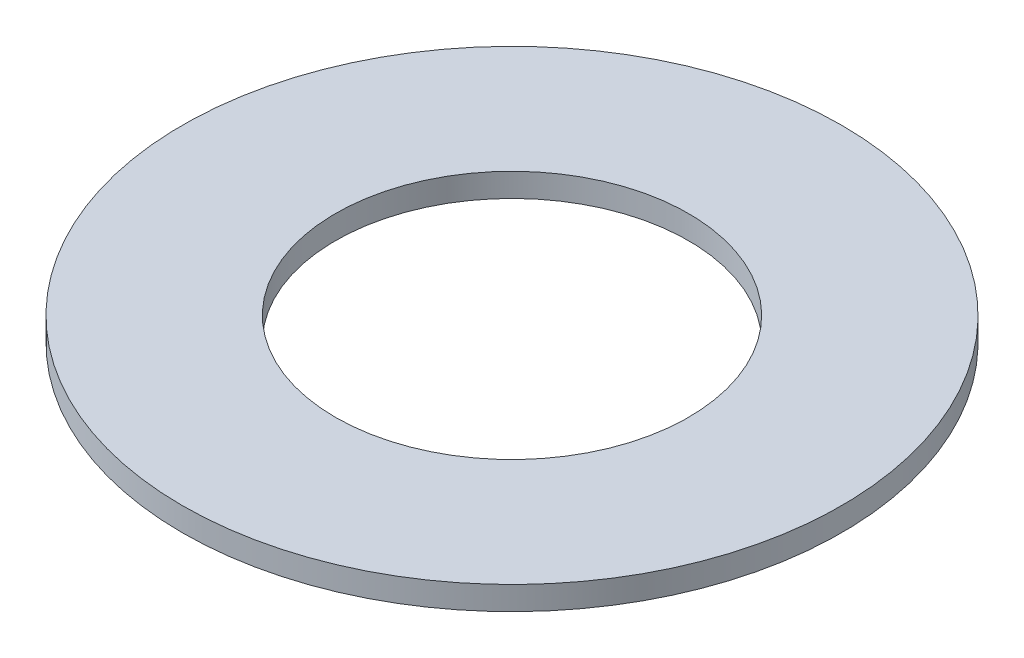
ISO-10303-21;
HEADER;
FILE_DESCRIPTION(('STEP AP214'),'2;1');
FILE_NAME('part.step','',(''),(''),'','','');
FILE_SCHEMA(('AUTOMOTIVE_DESIGN { 1 0 10303 214 1 1 1 1 }'));
ENDSEC;
DATA;
#1=APPLICATION_CONTEXT('core data for automotive mechanical design processes');
#2=APPLICATION_PROTOCOL_DEFINITION('international standard','automotive_design',2000,#1);
#3=PRODUCT_CONTEXT('',#1,'mechanical');
#4=PRODUCT('Part','Part','',(#3));
#5=PRODUCT_RELATED_PRODUCT_CATEGORY('part','',(#4));
#6=PRODUCT_DEFINITION_FORMATION('','',#4);
#7=PRODUCT_DEFINITION_CONTEXT('part definition',#1,'design');
#8=PRODUCT_DEFINITION('design','',#6,#7);
#9=PRODUCT_DEFINITION_SHAPE('','',#8);
#10=(LENGTH_UNIT() NAMED_UNIT(*) SI_UNIT(.MILLI.,.METRE.));
#11=(NAMED_UNIT(*) PLANE_ANGLE_UNIT() SI_UNIT($,.RADIAN.));
#12=(NAMED_UNIT(*) SI_UNIT($,.STERADIAN.) SOLID_ANGLE_UNIT());
#13=UNCERTAINTY_MEASURE_WITH_UNIT(LENGTH_MEASURE(1.E-05),#10,'distance_accuracy_value','');
#14=(GEOMETRIC_REPRESENTATION_CONTEXT(3) GLOBAL_UNCERTAINTY_ASSIGNED_CONTEXT((#13)) GLOBAL_UNIT_ASSIGNED_CONTEXT((#10,
#11,#12)) REPRESENTATION_CONTEXT('',''));
#15=CARTESIAN_POINT('',(0.,0.,0.));
#16=DIRECTION('',(0.,0.,1.));
#17=DIRECTION('',(1.,0.,0.));
#18=AXIS2_PLACEMENT_3D('',#15,#16,#17);
#19=CARTESIAN_POINT('',(0.,5.,0.));
#20=DIRECTION('',(0.,-1.,0.));
#21=DIRECTION('',(0.,0.,-1.));
#22=AXIS2_PLACEMENT_3D('',#19,#20,#21);
#23=CYLINDRICAL_SURFACE('',#22,70.);
#24=CARTESIAN_POINT('',(0.,5.,0.));
#25=DIRECTION('',(0.,1.,0.));
#26=DIRECTION('',(0.,0.,1.));
#27=AXIS2_PLACEMENT_3D('',#24,#25,#26);
#28=CIRCLE('',#27,70.);
#29=CARTESIAN_POINT('',(0.,5.,70.));
#30=VERTEX_POINT('',#29);
#31=EDGE_CURVE('E10',#30,#30,#28,.T.);
#32=ORIENTED_EDGE('',*,*,#31,.F.);
#33=EDGE_LOOP('',(#32));
#34=FACE_BOUND('',#33,.T.);
#35=CARTESIAN_POINT('',(0.,0.,0.));
#36=DIRECTION('',(0.,1.,0.));
#37=DIRECTION('',(0.,0.,1.));
#38=AXIS2_PLACEMENT_3D('',#35,#36,#37);
#39=CIRCLE('',#38,70.);
#40=CARTESIAN_POINT('',(0.,0.,70.));
#41=VERTEX_POINT('',#40);
#42=EDGE_CURVE('E37',#41,#41,#39,.T.);
#43=ORIENTED_EDGE('',*,*,#42,.T.);
#44=EDGE_LOOP('',(#43));
#45=FACE_BOUND('',#44,.T.);
#46=ADVANCED_FACE('F40',(#34,#45),#23,.T.);
#47=CARTESIAN_POINT('',(0.,5.,0.));
#48=DIRECTION('',(0.,1.,0.));
#49=DIRECTION('',(0.,0.,1.));
#50=AXIS2_PLACEMENT_3D('',#47,#48,#49);
#51=PLANE('',#50);
#52=CARTESIAN_POINT('',(0.,5.,0.));
#53=DIRECTION('',(0.,1.,0.));
#54=DIRECTION('',(0.,0.,1.));
#55=AXIS2_PLACEMENT_3D('',#52,#53,#54);
#56=CIRCLE('',#55,37.5);
#57=CARTESIAN_POINT('',(0.,5.,37.5));
#58=VERTEX_POINT('',#57);
#59=EDGE_CURVE('E50',#58,#58,#56,.T.);
#60=ORIENTED_EDGE('',*,*,#59,.F.);
#61=EDGE_LOOP('',(#60));
#62=FACE_BOUND('',#61,.T.);
#63=ORIENTED_EDGE('',*,*,#31,.T.);
#64=EDGE_LOOP('',(#63));
#65=FACE_BOUND('',#64,.T.);
#66=ADVANCED_FACE('F59',(#62,#65),#51,.T.);
#67=CARTESIAN_POINT('',(0.,0.,0.));
#68=DIRECTION('',(0.,1.,0.));
#69=DIRECTION('',(0.,0.,1.));
#70=AXIS2_PLACEMENT_3D('',#67,#68,#69);
#71=PLANE('',#70);
#72=CARTESIAN_POINT('',(0.,0.,0.));
#73=DIRECTION('',(0.,1.,0.));
#74=DIRECTION('',(0.,0.,1.));
#75=AXIS2_PLACEMENT_3D('',#72,#73,#74);
#76=CIRCLE('',#75,37.5);
#77=CARTESIAN_POINT('',(0.,0.,37.5));
#78=VERTEX_POINT('',#77);
#79=EDGE_CURVE('E47',#78,#78,#76,.T.);
#80=ORIENTED_EDGE('',*,*,#79,.T.);
#81=EDGE_LOOP('',(#80));
#82=FACE_BOUND('',#81,.T.);
#83=ORIENTED_EDGE('',*,*,#42,.F.);
#84=EDGE_LOOP('',(#83));
#85=FACE_BOUND('',#84,.T.);
#86=ADVANCED_FACE('F58',(#82,#85),#71,.F.);
#87=CARTESIAN_POINT('',(0.,5.,0.));
#88=DIRECTION('',(0.,-1.,0.));
#89=DIRECTION('',(0.,0.,-1.));
#90=AXIS2_PLACEMENT_3D('',#87,#88,#89);
#91=CYLINDRICAL_SURFACE('',#90,37.5);
#92=ORIENTED_EDGE('',*,*,#59,.T.);
#93=EDGE_LOOP('',(#92));
#94=FACE_BOUND('',#93,.T.);
#95=ORIENTED_EDGE('',*,*,#79,.F.);
#96=EDGE_LOOP('',(#95));
#97=FACE_BOUND('',#96,.T.);
#98=ADVANCED_FACE('F54',(#94,#97),#91,.F.);
#99=CLOSED_SHELL('',(#46,#66,#86,#98));
#100=MANIFOLD_SOLID_BREP('B2',#99);
#101=ADVANCED_BREP_SHAPE_REPRESENTATION('',(#18,#100),#14);
#102=SHAPE_DEFINITION_REPRESENTATION(#9,#101);
ENDSEC;
END-ISO-10303-21;
